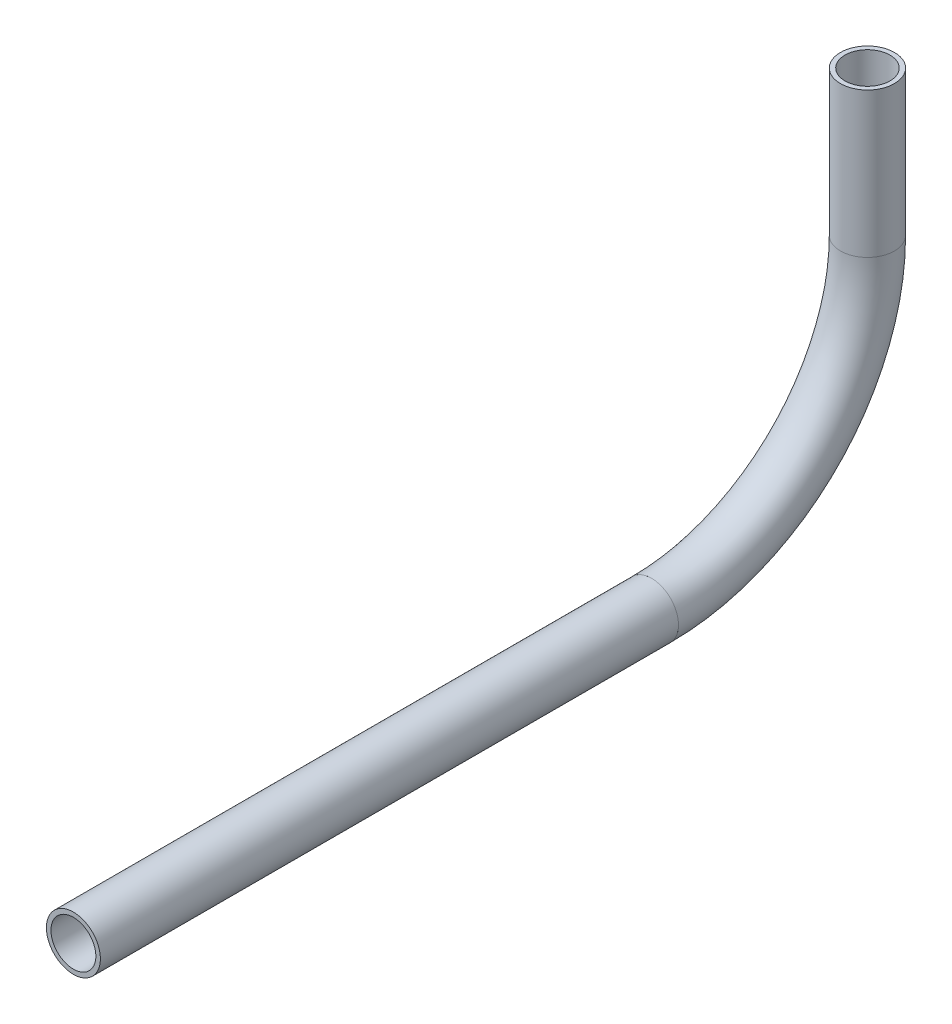
ISO-10303-21;
HEADER;
FILE_DESCRIPTION(('STEP AP214'),'2;1');
FILE_NAME('part.step','',(''),(''),'','','');
FILE_SCHEMA(('AUTOMOTIVE_DESIGN { 1 0 10303 214 1 1 1 1 }'));
ENDSEC;
DATA;
#1=APPLICATION_CONTEXT('core data for automotive mechanical design processes');
#2=APPLICATION_PROTOCOL_DEFINITION('international standard','automotive_design',2000,#1);
#3=PRODUCT_CONTEXT('',#1,'mechanical');
#4=PRODUCT('Part','Part','',(#3));
#5=PRODUCT_RELATED_PRODUCT_CATEGORY('part','',(#4));
#6=PRODUCT_DEFINITION_FORMATION('','',#4);
#7=PRODUCT_DEFINITION_CONTEXT('part definition',#1,'design');
#8=PRODUCT_DEFINITION('design','',#6,#7);
#9=PRODUCT_DEFINITION_SHAPE('','',#8);
#10=(LENGTH_UNIT() NAMED_UNIT(*) SI_UNIT(.MILLI.,.METRE.));
#11=(NAMED_UNIT(*) PLANE_ANGLE_UNIT() SI_UNIT($,.RADIAN.));
#12=(NAMED_UNIT(*) SI_UNIT($,.STERADIAN.) SOLID_ANGLE_UNIT());
#13=UNCERTAINTY_MEASURE_WITH_UNIT(LENGTH_MEASURE(1.E-05),#10,'distance_accuracy_value','');
#14=(GEOMETRIC_REPRESENTATION_CONTEXT(3) GLOBAL_UNCERTAINTY_ASSIGNED_CONTEXT((#13)) GLOBAL_UNIT_ASSIGNED_CONTEXT((#10,
#11,#12)) REPRESENTATION_CONTEXT('',''));
#15=CARTESIAN_POINT('',(0.,0.,0.));
#16=DIRECTION('',(0.,0.,1.));
#17=DIRECTION('',(1.,0.,0.));
#18=AXIS2_PLACEMENT_3D('',#15,#16,#17);
#19=CARTESIAN_POINT('',(0.,599.96001927236,167.15895807332));
#20=DIRECTION('',(0.,0.,1.));
#21=DIRECTION('',(1.,0.,0.));
#22=AXIS2_PLACEMENT_3D('',#19,#20,#21);
#23=CYLINDRICAL_SURFACE('',#22,5.28320000000004);
#24=CARTESIAN_POINT('',(0.,599.96001927236,303.16459571102));
#25=DIRECTION('',(0.,0.,-1.));
#26=DIRECTION('',(-1.,0.,0.));
#27=AXIS2_PLACEMENT_3D('',#24,#25,#26);
#28=CIRCLE('',#27,5.28320000000004);
#29=CARTESIAN_POINT('',(-5.28320000000004,599.96001927236,303.16459571102));
#30=VERTEX_POINT('',#29);
#31=EDGE_CURVE('E55',#30,#30,#28,.T.);
#32=ORIENTED_EDGE('',*,*,#31,.F.);
#33=EDGE_LOOP('',(#32));
#34=FACE_BOUND('',#33,.T.);
#35=CARTESIAN_POINT('',(0.,599.96001927236,167.15895807332));
#36=DIRECTION('',(0.,0.,-1.));
#37=DIRECTION('',(-1.,0.,0.));
#38=AXIS2_PLACEMENT_3D('',#35,#36,#37);
#39=CIRCLE('',#38,5.28320000000004);
#40=CARTESIAN_POINT('',(-5.28320000000004,599.96001927236,167.15895807332));
#41=VERTEX_POINT('',#40);
#42=EDGE_CURVE('E51',#41,#41,#39,.T.);
#43=ORIENTED_EDGE('',*,*,#42,.T.);
#44=EDGE_LOOP('',(#43));
#45=FACE_BOUND('',#44,.T.);
#46=ADVANCED_FACE('F47',(#34,#45),#23,.F.);
#47=CARTESIAN_POINT('',(0.,599.96001927236,167.15895807332));
#48=DIRECTION('',(0.,0.,1.));
#49=DIRECTION('',(1.,0.,0.));
#50=AXIS2_PLACEMENT_3D('',#47,#48,#49);
#51=CYLINDRICAL_SURFACE('',#50,6.35000000000005);
#52=CARTESIAN_POINT('',(0.,599.96001927236,303.16459571102));
#53=DIRECTION('',(0.,0.,-1.));
#54=DIRECTION('',(-1.,0.,0.));
#55=AXIS2_PLACEMENT_3D('',#52,#53,#54);
#56=CIRCLE('',#55,6.35000000000005);
#57=CARTESIAN_POINT('',(-6.35000000000005,599.96001927236,303.16459571102));
#58=VERTEX_POINT('',#57);
#59=EDGE_CURVE('E59',#58,#58,#56,.T.);
#60=ORIENTED_EDGE('',*,*,#59,.T.);
#61=EDGE_LOOP('',(#60));
#62=FACE_BOUND('',#61,.T.);
#63=CARTESIAN_POINT('',(0.,599.96001927236,167.15895807332));
#64=DIRECTION('',(0.,0.,-1.));
#65=DIRECTION('',(-1.,0.,0.));
#66=AXIS2_PLACEMENT_3D('',#63,#64,#65);
#67=CIRCLE('',#66,6.35000000000005);
#68=CARTESIAN_POINT('',(-6.35000000000005,599.96001927236,167.15895807332));
#69=VERTEX_POINT('',#68);
#70=EDGE_CURVE('E12',#69,#69,#67,.T.);
#71=ORIENTED_EDGE('',*,*,#70,.F.);
#72=EDGE_LOOP('',(#71));
#73=FACE_BOUND('',#72,.T.);
#74=ADVANCED_FACE('F74',(#62,#73),#51,.T.);
#75=CARTESIAN_POINT('',(0.,599.96001927236,303.16459571102));
#76=DIRECTION('',(0.,0.,-1.));
#77=DIRECTION('',(-1.,0.,0.));
#78=AXIS2_PLACEMENT_3D('',#75,#76,#77);
#79=PLANE('',#78);
#80=ORIENTED_EDGE('',*,*,#31,.T.);
#81=EDGE_LOOP('',(#80));
#82=FACE_BOUND('',#81,.T.);
#83=ORIENTED_EDGE('',*,*,#59,.F.);
#84=EDGE_LOOP('',(#83));
#85=FACE_BOUND('',#84,.T.);
#86=ADVANCED_FACE('F70',(#82,#85),#79,.F.);
#87=CARTESIAN_POINT('',(0.,599.96001927236,167.15895807332));
#88=DIRECTION('',(0.,0.,-1.));
#89=DIRECTION('',(-1.,0.,0.));
#90=AXIS2_PLACEMENT_3D('',#87,#88,#89);
#91=PLANE('',#90);
#92=ORIENTED_EDGE('',*,*,#42,.F.);
#93=EDGE_LOOP('',(#92));
#94=FACE_BOUND('',#93,.T.);
#95=ORIENTED_EDGE('',*,*,#70,.T.);
#96=EDGE_LOOP('',(#95));
#97=FACE_BOUND('',#96,.T.);
#98=ADVANCED_FACE('F49',(#94,#97),#91,.T.);
#99=CLOSED_SHELL('',(#46,#74,#86,#98));
#100=MANIFOLD_SOLID_BREP('B2',#99);
#101=CARTESIAN_POINT('',(0.,650.76001927236,167.15895807332));
#102=DIRECTION('',(-1.,0.,0.));
#103=DIRECTION('',(0.,0.,1.));
#104=AXIS2_PLACEMENT_3D('',#101,#102,#103);
#105=TOROIDAL_SURFACE('',#104,50.8,5.28320000000004);
#106=CARTESIAN_POINT('',(0.,650.76001927236,116.35895807332));
#107=DIRECTION('',(0.,1.,0.));
#108=DIRECTION('',(0.,0.,1.));
#109=AXIS2_PLACEMENT_3D('',#106,#107,#108);
#110=CIRCLE('',#109,5.28320000000004);
#111=CARTESIAN_POINT('',(0.,650.76001927236,111.07575807332));
#112=VERTEX_POINT('',#111);
#113=EDGE_CURVE('E150',#112,#112,#110,.T.);
#114=CARTESIAN_POINT('',(0.,599.96001927236,167.15895807332));
#115=DIRECTION('',(0.,0.,1.));
#116=DIRECTION('',(1.,0.,0.));
#117=AXIS2_PLACEMENT_3D('',#114,#115,#116);
#118=CIRCLE('',#117,5.28320000000004);
#119=CARTESIAN_POINT('',(0.,594.67681927236,167.15895807332));
#120=VERTEX_POINT('',#119);
#121=EDGE_CURVE('E140',#120,#120,#118,.T.);
#122=CARTESIAN_POINT('',(0.,650.76001927236,167.15895807332));
#123=DIRECTION('',(-1.,0.,0.));
#124=DIRECTION('',(0.,0.,1.));
#125=AXIS2_PLACEMENT_3D('',#122,#123,#124);
#126=CIRCLE('',#125,56.0832000000001);
#127=EDGE_CURVE('',#112,#120,#126,.T.);
#128=ORIENTED_EDGE('',*,*,#113,.T.);
#129=ORIENTED_EDGE('',*,*,#121,.T.);
#130=ORIENTED_EDGE('',*,*,#127,.T.);
#131=ORIENTED_EDGE('',*,*,#127,.F.);
#132=EDGE_LOOP('',(#128,#130,#129,#131));
#133=FACE_BOUND('',#132,.T.);
#134=ADVANCED_FACE('F136',(#133),#105,.F.);
#135=CARTESIAN_POINT('',(0.,650.76001927236,167.15895807332));
#136=DIRECTION('',(-1.,0.,0.));
#137=DIRECTION('',(0.,0.,1.));
#138=AXIS2_PLACEMENT_3D('',#135,#136,#137);
#139=TOROIDAL_SURFACE('',#138,50.8,6.35000000000005);
#140=CARTESIAN_POINT('',(0.,650.76001927236,116.35895807332));
#141=DIRECTION('',(0.,1.,0.));
#142=DIRECTION('',(0.,0.,1.));
#143=AXIS2_PLACEMENT_3D('',#140,#141,#142);
#144=CIRCLE('',#143,6.35000000000005);
#145=CARTESIAN_POINT('',(0.,650.76001927236,110.00895807332));
#146=VERTEX_POINT('',#145);
#147=EDGE_CURVE('E144',#146,#146,#144,.T.);
#148=CARTESIAN_POINT('',(0.,599.96001927236,167.15895807332));
#149=DIRECTION('',(0.,0.,1.));
#150=DIRECTION('',(1.,0.,0.));
#151=AXIS2_PLACEMENT_3D('',#148,#149,#150);
#152=CIRCLE('',#151,6.35000000000005);
#153=CARTESIAN_POINT('',(0.,593.61001927236,167.15895807332));
#154=VERTEX_POINT('',#153);
#155=EDGE_CURVE('E46',#154,#154,#152,.T.);
#156=CARTESIAN_POINT('',(0.,650.76001927236,167.15895807332));
#157=DIRECTION('',(-1.,0.,0.));
#158=DIRECTION('',(0.,0.,1.));
#159=AXIS2_PLACEMENT_3D('',#156,#157,#158);
#160=CIRCLE('',#159,57.1500000000001);
#161=EDGE_CURVE('',#146,#154,#160,.T.);
#162=ORIENTED_EDGE('',*,*,#147,.F.);
#163=ORIENTED_EDGE('',*,*,#155,.F.);
#164=ORIENTED_EDGE('',*,*,#161,.T.);
#165=ORIENTED_EDGE('',*,*,#161,.F.);
#166=EDGE_LOOP('',(#162,#164,#163,#165));
#167=FACE_BOUND('',#166,.T.);
#168=ADVANCED_FACE('F163',(#167),#139,.T.);
#169=CARTESIAN_POINT('',(0.,650.76001927236,116.35895807332));
#170=DIRECTION('',(0.,1.,0.));
#171=DIRECTION('',(0.,0.,1.));
#172=AXIS2_PLACEMENT_3D('',#169,#170,#171);
#173=PLANE('',#172);
#174=ORIENTED_EDGE('',*,*,#113,.F.);
#175=EDGE_LOOP('',(#174));
#176=FACE_BOUND('',#175,.T.);
#177=ORIENTED_EDGE('',*,*,#147,.T.);
#178=EDGE_LOOP('',(#177));
#179=FACE_BOUND('',#178,.T.);
#180=ADVANCED_FACE('F159',(#176,#179),#173,.T.);
#181=CARTESIAN_POINT('',(0.,599.96001927236,167.15895807332));
#182=DIRECTION('',(0.,0.,1.));
#183=DIRECTION('',(1.,0.,0.));
#184=AXIS2_PLACEMENT_3D('',#181,#182,#183);
#185=PLANE('',#184);
#186=ORIENTED_EDGE('',*,*,#121,.F.);
#187=EDGE_LOOP('',(#186));
#188=FACE_BOUND('',#187,.T.);
#189=ORIENTED_EDGE('',*,*,#155,.T.);
#190=EDGE_LOOP('',(#189));
#191=FACE_BOUND('',#190,.T.);
#192=ADVANCED_FACE('F138',(#188,#191),#185,.T.);
#193=CLOSED_SHELL('',(#134,#168,#180,#192));
#194=MANIFOLD_SOLID_BREP('B7',#193);
#195=CARTESIAN_POINT('',(0.,684.869031623386,116.35895807332));
#196=DIRECTION('',(0.,-1.,0.));
#197=DIRECTION('',(0.,0.,-1.));
#198=AXIS2_PLACEMENT_3D('',#195,#196,#197);
#199=CYLINDRICAL_SURFACE('',#198,5.28320000000004);
#200=CARTESIAN_POINT('',(0.,684.869031623386,116.35895807332));
#201=DIRECTION('',(0.,1.,0.));
#202=DIRECTION('',(-1.,0.,0.));
#203=AXIS2_PLACEMENT_3D('',#200,#201,#202);
#204=CIRCLE('',#203,5.28320000000004);
#205=CARTESIAN_POINT('',(-5.28320000000004,684.869031623386,116.35895807332));
#206=VERTEX_POINT('',#205);
#207=EDGE_CURVE('E234',#206,#206,#204,.T.);
#208=ORIENTED_EDGE('',*,*,#207,.T.);
#209=EDGE_LOOP('',(#208));
#210=FACE_BOUND('',#209,.T.);
#211=CARTESIAN_POINT('',(0.,650.76001927236,116.35895807332));
#212=DIRECTION('',(0.,-1.,0.));
#213=DIRECTION('',(0.,0.,-1.));
#214=AXIS2_PLACEMENT_3D('',#211,#212,#213);
#215=CIRCLE('',#214,5.28320000000004);
#216=CARTESIAN_POINT('',(0.,650.76001927236,111.07575807332));
#217=VERTEX_POINT('',#216);
#218=EDGE_CURVE('E224',#217,#217,#215,.T.);
#219=ORIENTED_EDGE('',*,*,#218,.T.);
#220=EDGE_LOOP('',(#219));
#221=FACE_BOUND('',#220,.T.);
#222=ADVANCED_FACE('F220',(#210,#221),#199,.F.);
#223=CARTESIAN_POINT('',(0.,684.869031623386,116.35895807332));
#224=DIRECTION('',(0.,-1.,0.));
#225=DIRECTION('',(0.,0.,-1.));
#226=AXIS2_PLACEMENT_3D('',#223,#224,#225);
#227=CYLINDRICAL_SURFACE('',#226,6.35000000000005);
#228=CARTESIAN_POINT('',(0.,684.869031623386,116.35895807332));
#229=DIRECTION('',(0.,1.,0.));
#230=DIRECTION('',(-1.,0.,0.));
#231=AXIS2_PLACEMENT_3D('',#228,#229,#230);
#232=CIRCLE('',#231,6.35000000000005);
#233=CARTESIAN_POINT('',(-6.35000000000005,684.869031623386,116.35895807332));
#234=VERTEX_POINT('',#233);
#235=EDGE_CURVE('E228',#234,#234,#232,.T.);
#236=ORIENTED_EDGE('',*,*,#235,.F.);
#237=EDGE_LOOP('',(#236));
#238=FACE_BOUND('',#237,.T.);
#239=CARTESIAN_POINT('',(0.,650.76001927236,116.35895807332));
#240=DIRECTION('',(0.,-1.,0.));
#241=DIRECTION('',(0.,0.,-1.));
#242=AXIS2_PLACEMENT_3D('',#239,#240,#241);
#243=CIRCLE('',#242,6.35000000000005);
#244=CARTESIAN_POINT('',(0.,650.76001927236,110.00895807332));
#245=VERTEX_POINT('',#244);
#246=EDGE_CURVE('E135',#245,#245,#243,.T.);
#247=ORIENTED_EDGE('',*,*,#246,.F.);
#248=EDGE_LOOP('',(#247));
#249=FACE_BOUND('',#248,.T.);
#250=ADVANCED_FACE('F247',(#238,#249),#227,.T.);
#251=CARTESIAN_POINT('',(0.,684.869031623386,116.35895807332));
#252=DIRECTION('',(0.,1.,0.));
#253=DIRECTION('',(-1.,0.,0.));
#254=AXIS2_PLACEMENT_3D('',#251,#252,#253);
#255=PLANE('',#254);
#256=ORIENTED_EDGE('',*,*,#207,.F.);
#257=EDGE_LOOP('',(#256));
#258=FACE_BOUND('',#257,.T.);
#259=ORIENTED_EDGE('',*,*,#235,.T.);
#260=EDGE_LOOP('',(#259));
#261=FACE_BOUND('',#260,.T.);
#262=ADVANCED_FACE('F243',(#258,#261),#255,.T.);
#263=CARTESIAN_POINT('',(0.,650.76001927236,116.35895807332));
#264=DIRECTION('',(0.,-1.,0.));
#265=DIRECTION('',(0.,0.,-1.));
#266=AXIS2_PLACEMENT_3D('',#263,#264,#265);
#267=PLANE('',#266);
#268=ORIENTED_EDGE('',*,*,#218,.F.);
#269=EDGE_LOOP('',(#268));
#270=FACE_BOUND('',#269,.T.);
#271=ORIENTED_EDGE('',*,*,#246,.T.);
#272=EDGE_LOOP('',(#271));
#273=FACE_BOUND('',#272,.T.);
#274=ADVANCED_FACE('F222',(#270,#273),#267,.T.);
#275=CLOSED_SHELL('',(#222,#250,#262,#274));
#276=MANIFOLD_SOLID_BREP('B41',#275);
#277=ADVANCED_BREP_SHAPE_REPRESENTATION('',(#18,#100,#194,#276),#14);
#278=SHAPE_DEFINITION_REPRESENTATION(#9,#277);
ENDSEC;
END-ISO-10303-21;
